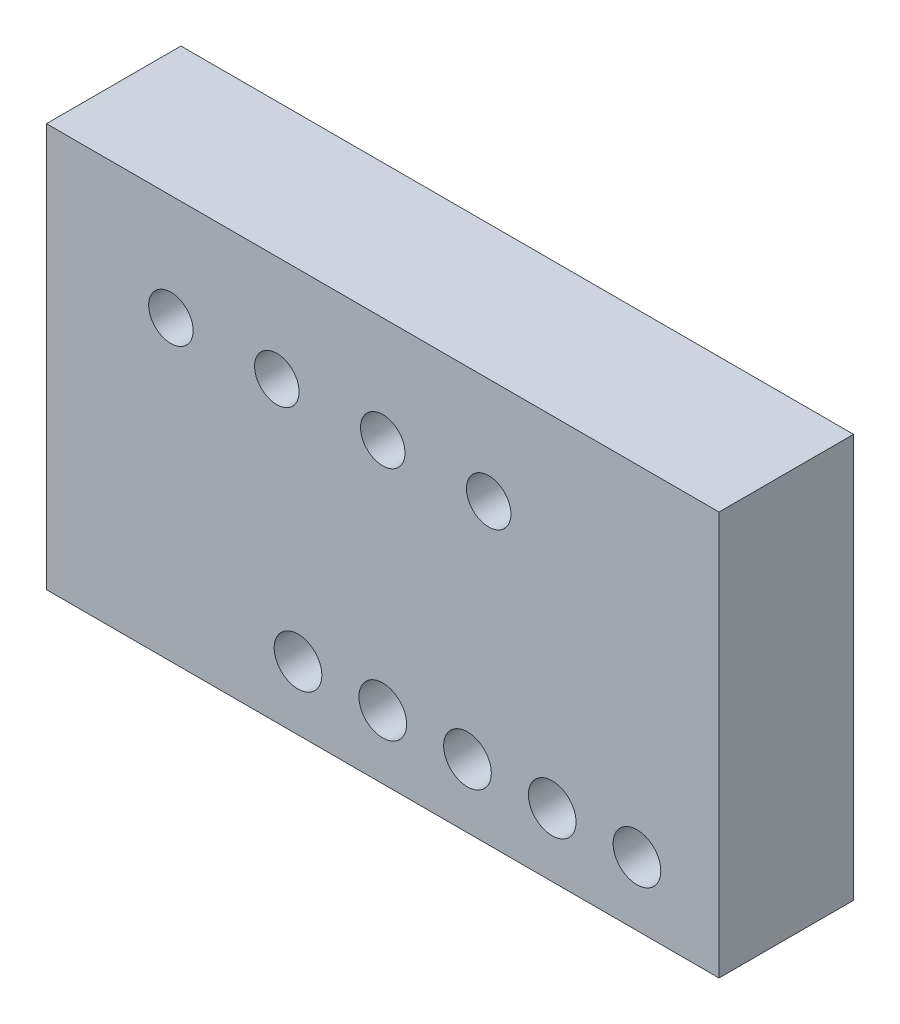
ISO-10303-21;
HEADER;
FILE_DESCRIPTION(('STEP AP214'),'2;1');
FILE_NAME('part.step','',(''),(''),'','','');
FILE_SCHEMA(('AUTOMOTIVE_DESIGN { 1 0 10303 214 1 1 1 1 }'));
ENDSEC;
DATA;
#1=APPLICATION_CONTEXT('core data for automotive mechanical design processes');
#2=APPLICATION_PROTOCOL_DEFINITION('international standard','automotive_design',2000,#1);
#3=PRODUCT_CONTEXT('',#1,'mechanical');
#4=PRODUCT('Part','Part','',(#3));
#5=PRODUCT_RELATED_PRODUCT_CATEGORY('part','',(#4));
#6=PRODUCT_DEFINITION_FORMATION('','',#4);
#7=PRODUCT_DEFINITION_CONTEXT('part definition',#1,'design');
#8=PRODUCT_DEFINITION('design','',#6,#7);
#9=PRODUCT_DEFINITION_SHAPE('','',#8);
#10=(LENGTH_UNIT() NAMED_UNIT(*) SI_UNIT(.MILLI.,.METRE.));
#11=(NAMED_UNIT(*) PLANE_ANGLE_UNIT() SI_UNIT($,.RADIAN.));
#12=(NAMED_UNIT(*) SI_UNIT($,.STERADIAN.) SOLID_ANGLE_UNIT());
#13=UNCERTAINTY_MEASURE_WITH_UNIT(LENGTH_MEASURE(1.E-05),#10,'distance_accuracy_value','');
#14=(GEOMETRIC_REPRESENTATION_CONTEXT(3) GLOBAL_UNCERTAINTY_ASSIGNED_CONTEXT((#13)) GLOBAL_UNIT_ASSIGNED_CONTEXT((#10,
#11,#12)) REPRESENTATION_CONTEXT('',''));
#15=CARTESIAN_POINT('',(0.,0.,0.));
#16=DIRECTION('',(0.,0.,1.));
#17=DIRECTION('',(1.,0.,0.));
#18=AXIS2_PLACEMENT_3D('',#15,#16,#17);
#19=CARTESIAN_POINT('',(-31.75,-19.05,12.7));
#20=DIRECTION('',(1.,0.,0.));
#21=DIRECTION('',(0.,0.,-1.));
#22=AXIS2_PLACEMENT_3D('',#19,#20,#21);
#23=PLANE('',#22);
#24=DIRECTION('',(0.,-1.,0.));
#25=VECTOR('',#24,1.);
#26=CARTESIAN_POINT('',(-31.75,-19.05,0.));
#27=LINE('',#26,#25);
#28=CARTESIAN_POINT('',(-31.75,19.05,0.));
#29=VERTEX_POINT('',#28);
#30=CARTESIAN_POINT('',(-31.75,-19.05,0.));
#31=VERTEX_POINT('',#30);
#32=EDGE_CURVE('E113',#29,#31,#27,.T.);
#33=ORIENTED_EDGE('',*,*,#32,.T.);
#34=DIRECTION('',(0.,0.,-1.));
#35=VECTOR('',#34,1.);
#36=CARTESIAN_POINT('',(-31.75,-19.05,12.7));
#37=LINE('',#36,#35);
#38=CARTESIAN_POINT('',(-31.75,-19.05,12.7));
#39=VERTEX_POINT('',#38);
#40=EDGE_CURVE('E11',#39,#31,#37,.T.);
#41=ORIENTED_EDGE('',*,*,#40,.F.);
#42=DIRECTION('',(0.,-1.,0.));
#43=VECTOR('',#42,1.);
#44=CARTESIAN_POINT('',(-31.75,-19.05,12.7));
#45=LINE('',#44,#43);
#46=CARTESIAN_POINT('',(-31.75,19.05,12.7));
#47=VERTEX_POINT('',#46);
#48=EDGE_CURVE('E95',#47,#39,#45,.T.);
#49=ORIENTED_EDGE('',*,*,#48,.F.);
#50=DIRECTION('',(0.,0.,-1.));
#51=VECTOR('',#50,1.);
#52=CARTESIAN_POINT('',(-31.75,19.05,12.7));
#53=LINE('',#52,#51);
#54=EDGE_CURVE('E109',#47,#29,#53,.T.);
#55=ORIENTED_EDGE('',*,*,#54,.T.);
#56=EDGE_LOOP('',(#33,#41,#49,#55));
#57=FACE_BOUND('',#56,.T.);
#58=ADVANCED_FACE('F43',(#57),#23,.F.);
#59=CARTESIAN_POINT('',(31.75,-19.05,12.7));
#60=DIRECTION('',(0.,1.,0.));
#61=DIRECTION('',(-1.,0.,0.));
#62=AXIS2_PLACEMENT_3D('',#59,#60,#61);
#63=PLANE('',#62);
#64=DIRECTION('',(1.,0.,0.));
#65=VECTOR('',#64,1.);
#66=CARTESIAN_POINT('',(31.75,-19.05,0.));
#67=LINE('',#66,#65);
#68=CARTESIAN_POINT('',(31.75,-19.05,0.));
#69=VERTEX_POINT('',#68);
#70=EDGE_CURVE('E100',#31,#69,#67,.T.);
#71=ORIENTED_EDGE('',*,*,#70,.T.);
#72=DIRECTION('',(0.,0.,-1.));
#73=VECTOR('',#72,1.);
#74=CARTESIAN_POINT('',(31.75,-19.05,12.7));
#75=LINE('',#74,#73);
#76=CARTESIAN_POINT('',(31.75,-19.05,12.7));
#77=VERTEX_POINT('',#76);
#78=EDGE_CURVE('E52',#77,#69,#75,.T.);
#79=ORIENTED_EDGE('',*,*,#78,.F.);
#80=DIRECTION('',(1.,0.,0.));
#81=VECTOR('',#80,1.);
#82=CARTESIAN_POINT('',(31.75,-19.05,12.7));
#83=LINE('',#82,#81);
#84=EDGE_CURVE('E90',#39,#77,#83,.T.);
#85=ORIENTED_EDGE('',*,*,#84,.F.);
#86=ORIENTED_EDGE('',*,*,#40,.T.);
#87=EDGE_LOOP('',(#71,#79,#85,#86));
#88=FACE_BOUND('',#87,.T.);
#89=ADVANCED_FACE('F99',(#88),#63,.F.);
#90=CARTESIAN_POINT('',(31.75,-19.05,12.7));
#91=DIRECTION('',(-1.,0.,0.));
#92=DIRECTION('',(0.,0.,1.));
#93=AXIS2_PLACEMENT_3D('',#90,#91,#92);
#94=PLANE('',#93);
#95=DIRECTION('',(0.,1.,0.));
#96=VECTOR('',#95,1.);
#97=CARTESIAN_POINT('',(31.75,-19.05,0.));
#98=LINE('',#97,#96);
#99=CARTESIAN_POINT('',(31.75,19.05,0.));
#100=VERTEX_POINT('',#99);
#101=EDGE_CURVE('E77',#69,#100,#98,.T.);
#102=ORIENTED_EDGE('',*,*,#101,.T.);
#103=DIRECTION('',(0.,0.,-1.));
#104=VECTOR('',#103,1.);
#105=CARTESIAN_POINT('',(31.75,19.05,12.7));
#106=LINE('',#105,#104);
#107=CARTESIAN_POINT('',(31.75,19.05,12.7));
#108=VERTEX_POINT('',#107);
#109=EDGE_CURVE('E102',#108,#100,#106,.T.);
#110=ORIENTED_EDGE('',*,*,#109,.F.);
#111=DIRECTION('',(0.,1.,0.));
#112=VECTOR('',#111,1.);
#113=CARTESIAN_POINT('',(31.75,-19.05,12.7));
#114=LINE('',#113,#112);
#115=EDGE_CURVE('E93',#77,#108,#114,.T.);
#116=ORIENTED_EDGE('',*,*,#115,.F.);
#117=ORIENTED_EDGE('',*,*,#78,.T.);
#118=EDGE_LOOP('',(#102,#110,#116,#117));
#119=FACE_BOUND('',#118,.T.);
#120=ADVANCED_FACE('F103',(#119),#94,.F.);
#121=CARTESIAN_POINT('',(31.75,19.05,12.7));
#122=DIRECTION('',(0.,-1.,0.));
#123=DIRECTION('',(1.,0.,0.));
#124=AXIS2_PLACEMENT_3D('',#121,#122,#123);
#125=PLANE('',#124);
#126=DIRECTION('',(-1.,0.,0.));
#127=VECTOR('',#126,1.);
#128=CARTESIAN_POINT('',(31.75,19.05,0.));
#129=LINE('',#128,#127);
#130=EDGE_CURVE('E83',#100,#29,#129,.T.);
#131=ORIENTED_EDGE('',*,*,#130,.T.);
#132=ORIENTED_EDGE('',*,*,#54,.F.);
#133=DIRECTION('',(-1.,0.,0.));
#134=VECTOR('',#133,1.);
#135=CARTESIAN_POINT('',(31.75,19.05,12.7));
#136=LINE('',#135,#134);
#137=EDGE_CURVE('E60',#108,#47,#136,.T.);
#138=ORIENTED_EDGE('',*,*,#137,.F.);
#139=ORIENTED_EDGE('',*,*,#109,.T.);
#140=EDGE_LOOP('',(#131,#132,#138,#139));
#141=FACE_BOUND('',#140,.T.);
#142=ADVANCED_FACE('F129',(#141),#125,.F.);
#143=CARTESIAN_POINT('',(0.,0.,12.7));
#144=DIRECTION('',(0.,0.,1.));
#145=DIRECTION('',(1.,0.,0.));
#146=AXIS2_PLACEMENT_3D('',#143,#144,#145);
#147=PLANE('',#146);
#148=CARTESIAN_POINT('',(-20.,9.04999999999999,12.7));
#149=DIRECTION('',(0.,0.,1.));
#150=DIRECTION('',(1.,0.,0.));
#151=AXIS2_PLACEMENT_3D('',#148,#149,#150);
#152=CIRCLE('',#151,2.1);
#153=CARTESIAN_POINT('',(-17.9,9.04999999999999,12.7));
#154=VERTEX_POINT('',#153);
#155=EDGE_CURVE('E205',#154,#154,#152,.T.);
#156=ORIENTED_EDGE('',*,*,#155,.F.);
#157=EDGE_LOOP('',(#156));
#158=FACE_BOUND('',#157,.T.);
#159=CARTESIAN_POINT('',(-10.,9.04999999999999,12.7));
#160=DIRECTION('',(0.,0.,1.));
#161=DIRECTION('',(1.,0.,0.));
#162=AXIS2_PLACEMENT_3D('',#159,#160,#161);
#163=CIRCLE('',#162,2.1);
#164=CARTESIAN_POINT('',(-7.9,9.04999999999999,12.7));
#165=VERTEX_POINT('',#164);
#166=EDGE_CURVE('E197',#165,#165,#163,.T.);
#167=ORIENTED_EDGE('',*,*,#166,.F.);
#168=EDGE_LOOP('',(#167));
#169=FACE_BOUND('',#168,.T.);
#170=CARTESIAN_POINT('',(0.,9.05,12.7));
#171=DIRECTION('',(0.,0.,1.));
#172=DIRECTION('',(1.,0.,0.));
#173=AXIS2_PLACEMENT_3D('',#170,#171,#172);
#174=CIRCLE('',#173,2.1);
#175=CARTESIAN_POINT('',(2.1,9.05,12.7));
#176=VERTEX_POINT('',#175);
#177=EDGE_CURVE('E189',#176,#176,#174,.T.);
#178=ORIENTED_EDGE('',*,*,#177,.F.);
#179=EDGE_LOOP('',(#178));
#180=FACE_BOUND('',#179,.T.);
#181=CARTESIAN_POINT('',(10.,9.04999999999999,12.7));
#182=DIRECTION('',(0.,0.,1.));
#183=DIRECTION('',(1.,0.,0.));
#184=AXIS2_PLACEMENT_3D('',#181,#182,#183);
#185=CIRCLE('',#184,2.1);
#186=CARTESIAN_POINT('',(12.1,9.04999999999999,12.7));
#187=VERTEX_POINT('',#186);
#188=EDGE_CURVE('E181',#187,#187,#185,.T.);
#189=ORIENTED_EDGE('',*,*,#188,.F.);
#190=EDGE_LOOP('',(#189));
#191=FACE_BOUND('',#190,.T.);
#192=CARTESIAN_POINT('',(-8.,-13.05,12.7));
#193=DIRECTION('',(0.,0.,1.));
#194=DIRECTION('',(1.,0.,0.));
#195=AXIS2_PLACEMENT_3D('',#192,#193,#194);
#196=CIRCLE('',#195,2.25);
#197=CARTESIAN_POINT('',(-5.75,-13.05,12.7));
#198=VERTEX_POINT('',#197);
#199=EDGE_CURVE('E173',#198,#198,#196,.T.);
#200=ORIENTED_EDGE('',*,*,#199,.F.);
#201=EDGE_LOOP('',(#200));
#202=FACE_BOUND('',#201,.T.);
#203=CARTESIAN_POINT('',(0.,-13.05,12.7));
#204=DIRECTION('',(0.,0.,1.));
#205=DIRECTION('',(1.,0.,0.));
#206=AXIS2_PLACEMENT_3D('',#203,#204,#205);
#207=CIRCLE('',#206,2.25);
#208=CARTESIAN_POINT('',(2.25,-13.05,12.7));
#209=VERTEX_POINT('',#208);
#210=EDGE_CURVE('E165',#209,#209,#207,.T.);
#211=ORIENTED_EDGE('',*,*,#210,.F.);
#212=EDGE_LOOP('',(#211));
#213=FACE_BOUND('',#212,.T.);
#214=CARTESIAN_POINT('',(8.,-13.05,12.7));
#215=DIRECTION('',(0.,0.,1.));
#216=DIRECTION('',(1.,0.,0.));
#217=AXIS2_PLACEMENT_3D('',#214,#215,#216);
#218=CIRCLE('',#217,2.25);
#219=CARTESIAN_POINT('',(10.25,-13.05,12.7));
#220=VERTEX_POINT('',#219);
#221=EDGE_CURVE('E157',#220,#220,#218,.T.);
#222=ORIENTED_EDGE('',*,*,#221,.F.);
#223=EDGE_LOOP('',(#222));
#224=FACE_BOUND('',#223,.T.);
#225=CARTESIAN_POINT('',(16.,-13.05,12.7));
#226=DIRECTION('',(0.,0.,1.));
#227=DIRECTION('',(1.,0.,0.));
#228=AXIS2_PLACEMENT_3D('',#225,#226,#227);
#229=CIRCLE('',#228,2.25);
#230=CARTESIAN_POINT('',(18.25,-13.05,12.7));
#231=VERTEX_POINT('',#230);
#232=EDGE_CURVE('E149',#231,#231,#229,.T.);
#233=ORIENTED_EDGE('',*,*,#232,.F.);
#234=EDGE_LOOP('',(#233));
#235=FACE_BOUND('',#234,.T.);
#236=CARTESIAN_POINT('',(24.,-13.05,12.7));
#237=DIRECTION('',(0.,0.,1.));
#238=DIRECTION('',(1.,0.,0.));
#239=AXIS2_PLACEMENT_3D('',#236,#237,#238);
#240=CIRCLE('',#239,2.25);
#241=CARTESIAN_POINT('',(26.25,-13.05,12.7));
#242=VERTEX_POINT('',#241);
#243=EDGE_CURVE('E141',#242,#242,#240,.T.);
#244=ORIENTED_EDGE('',*,*,#243,.F.);
#245=EDGE_LOOP('',(#244));
#246=FACE_BOUND('',#245,.T.);
#247=ORIENTED_EDGE('',*,*,#48,.T.);
#248=ORIENTED_EDGE('',*,*,#84,.T.);
#249=ORIENTED_EDGE('',*,*,#115,.T.);
#250=ORIENTED_EDGE('',*,*,#137,.T.);
#251=EDGE_LOOP('',(#247,#248,#249,#250));
#252=FACE_BOUND('',#251,.T.);
#253=ADVANCED_FACE('F91',(#158,#169,#180,#191,#202,#213,#224,#235,#246,#252),#147,.T.);
#254=CARTESIAN_POINT('',(0.,0.,0.));
#255=DIRECTION('',(0.,0.,1.));
#256=DIRECTION('',(1.,0.,0.));
#257=AXIS2_PLACEMENT_3D('',#254,#255,#256);
#258=PLANE('',#257);
#259=CARTESIAN_POINT('',(-20.,9.04999999999999,0.));
#260=DIRECTION('',(0.,0.,1.));
#261=DIRECTION('',(1.,0.,0.));
#262=AXIS2_PLACEMENT_3D('',#259,#260,#261);
#263=CIRCLE('',#262,2.1);
#264=CARTESIAN_POINT('',(-17.9,9.04999999999999,0.));
#265=VERTEX_POINT('',#264);
#266=EDGE_CURVE('E201',#265,#265,#263,.T.);
#267=ORIENTED_EDGE('',*,*,#266,.T.);
#268=EDGE_LOOP('',(#267));
#269=FACE_BOUND('',#268,.T.);
#270=CARTESIAN_POINT('',(-10.,9.04999999999999,0.));
#271=DIRECTION('',(0.,0.,1.));
#272=DIRECTION('',(1.,0.,0.));
#273=AXIS2_PLACEMENT_3D('',#270,#271,#272);
#274=CIRCLE('',#273,2.1);
#275=CARTESIAN_POINT('',(-7.9,9.04999999999999,0.));
#276=VERTEX_POINT('',#275);
#277=EDGE_CURVE('E193',#276,#276,#274,.T.);
#278=ORIENTED_EDGE('',*,*,#277,.T.);
#279=EDGE_LOOP('',(#278));
#280=FACE_BOUND('',#279,.T.);
#281=CARTESIAN_POINT('',(0.,9.05,0.));
#282=DIRECTION('',(0.,0.,1.));
#283=DIRECTION('',(1.,0.,0.));
#284=AXIS2_PLACEMENT_3D('',#281,#282,#283);
#285=CIRCLE('',#284,2.1);
#286=CARTESIAN_POINT('',(2.1,9.05,0.));
#287=VERTEX_POINT('',#286);
#288=EDGE_CURVE('E185',#287,#287,#285,.T.);
#289=ORIENTED_EDGE('',*,*,#288,.T.);
#290=EDGE_LOOP('',(#289));
#291=FACE_BOUND('',#290,.T.);
#292=CARTESIAN_POINT('',(10.,9.04999999999999,0.));
#293=DIRECTION('',(0.,0.,1.));
#294=DIRECTION('',(1.,0.,0.));
#295=AXIS2_PLACEMENT_3D('',#292,#293,#294);
#296=CIRCLE('',#295,2.1);
#297=CARTESIAN_POINT('',(12.1,9.04999999999999,0.));
#298=VERTEX_POINT('',#297);
#299=EDGE_CURVE('E177',#298,#298,#296,.T.);
#300=ORIENTED_EDGE('',*,*,#299,.T.);
#301=EDGE_LOOP('',(#300));
#302=FACE_BOUND('',#301,.T.);
#303=CARTESIAN_POINT('',(-8.,-13.05,0.));
#304=DIRECTION('',(0.,0.,1.));
#305=DIRECTION('',(1.,0.,0.));
#306=AXIS2_PLACEMENT_3D('',#303,#304,#305);
#307=CIRCLE('',#306,2.25);
#308=CARTESIAN_POINT('',(-5.75,-13.05,0.));
#309=VERTEX_POINT('',#308);
#310=EDGE_CURVE('E169',#309,#309,#307,.T.);
#311=ORIENTED_EDGE('',*,*,#310,.T.);
#312=EDGE_LOOP('',(#311));
#313=FACE_BOUND('',#312,.T.);
#314=CARTESIAN_POINT('',(0.,-13.05,0.));
#315=DIRECTION('',(0.,0.,1.));
#316=DIRECTION('',(1.,0.,0.));
#317=AXIS2_PLACEMENT_3D('',#314,#315,#316);
#318=CIRCLE('',#317,2.25);
#319=CARTESIAN_POINT('',(2.25,-13.05,0.));
#320=VERTEX_POINT('',#319);
#321=EDGE_CURVE('E161',#320,#320,#318,.T.);
#322=ORIENTED_EDGE('',*,*,#321,.T.);
#323=EDGE_LOOP('',(#322));
#324=FACE_BOUND('',#323,.T.);
#325=CARTESIAN_POINT('',(8.,-13.05,0.));
#326=DIRECTION('',(0.,0.,1.));
#327=DIRECTION('',(1.,0.,0.));
#328=AXIS2_PLACEMENT_3D('',#325,#326,#327);
#329=CIRCLE('',#328,2.25);
#330=CARTESIAN_POINT('',(10.25,-13.05,0.));
#331=VERTEX_POINT('',#330);
#332=EDGE_CURVE('E153',#331,#331,#329,.T.);
#333=ORIENTED_EDGE('',*,*,#332,.T.);
#334=EDGE_LOOP('',(#333));
#335=FACE_BOUND('',#334,.T.);
#336=CARTESIAN_POINT('',(16.,-13.05,0.));
#337=DIRECTION('',(0.,0.,1.));
#338=DIRECTION('',(1.,0.,0.));
#339=AXIS2_PLACEMENT_3D('',#336,#337,#338);
#340=CIRCLE('',#339,2.25);
#341=CARTESIAN_POINT('',(18.25,-13.05,0.));
#342=VERTEX_POINT('',#341);
#343=EDGE_CURVE('E145',#342,#342,#340,.T.);
#344=ORIENTED_EDGE('',*,*,#343,.T.);
#345=EDGE_LOOP('',(#344));
#346=FACE_BOUND('',#345,.T.);
#347=CARTESIAN_POINT('',(24.,-13.05,0.));
#348=DIRECTION('',(0.,0.,1.));
#349=DIRECTION('',(1.,0.,0.));
#350=AXIS2_PLACEMENT_3D('',#347,#348,#349);
#351=CIRCLE('',#350,2.25);
#352=CARTESIAN_POINT('',(26.25,-13.05,0.));
#353=VERTEX_POINT('',#352);
#354=EDGE_CURVE('E117',#353,#353,#351,.T.);
#355=ORIENTED_EDGE('',*,*,#354,.T.);
#356=EDGE_LOOP('',(#355));
#357=FACE_BOUND('',#356,.T.);
#358=ORIENTED_EDGE('',*,*,#32,.F.);
#359=ORIENTED_EDGE('',*,*,#130,.F.);
#360=ORIENTED_EDGE('',*,*,#101,.F.);
#361=ORIENTED_EDGE('',*,*,#70,.F.);
#362=EDGE_LOOP('',(#358,#359,#360,#361));
#363=FACE_BOUND('',#362,.T.);
#364=ADVANCED_FACE('F132',(#269,#280,#291,#302,#313,#324,#335,#346,#357,#363),#258,.F.);
#365=CARTESIAN_POINT('',(24.,-13.05,12.7));
#366=DIRECTION('',(0.,0.,1.));
#367=DIRECTION('',(1.,0.,0.));
#368=AXIS2_PLACEMENT_3D('',#365,#366,#367);
#369=CYLINDRICAL_SURFACE('',#368,2.25);
#370=ORIENTED_EDGE('',*,*,#354,.F.);
#371=EDGE_LOOP('',(#370));
#372=FACE_BOUND('',#371,.T.);
#373=ORIENTED_EDGE('',*,*,#243,.T.);
#374=EDGE_LOOP('',(#373));
#375=FACE_BOUND('',#374,.T.);
#376=ADVANCED_FACE('F233',(#372,#375),#369,.F.);
#377=CARTESIAN_POINT('',(16.,-13.05,12.7));
#378=DIRECTION('',(0.,0.,1.));
#379=DIRECTION('',(1.,0.,0.));
#380=AXIS2_PLACEMENT_3D('',#377,#378,#379);
#381=CYLINDRICAL_SURFACE('',#380,2.25);
#382=ORIENTED_EDGE('',*,*,#343,.F.);
#383=EDGE_LOOP('',(#382));
#384=FACE_BOUND('',#383,.T.);
#385=ORIENTED_EDGE('',*,*,#232,.T.);
#386=EDGE_LOOP('',(#385));
#387=FACE_BOUND('',#386,.T.);
#388=ADVANCED_FACE('F235',(#384,#387),#381,.F.);
#389=CARTESIAN_POINT('',(8.,-13.05,12.7));
#390=DIRECTION('',(0.,0.,1.));
#391=DIRECTION('',(1.,0.,0.));
#392=AXIS2_PLACEMENT_3D('',#389,#390,#391);
#393=CYLINDRICAL_SURFACE('',#392,2.25);
#394=ORIENTED_EDGE('',*,*,#332,.F.);
#395=EDGE_LOOP('',(#394));
#396=FACE_BOUND('',#395,.T.);
#397=ORIENTED_EDGE('',*,*,#221,.T.);
#398=EDGE_LOOP('',(#397));
#399=FACE_BOUND('',#398,.T.);
#400=ADVANCED_FACE('F242',(#396,#399),#393,.F.);
#401=CARTESIAN_POINT('',(0.,-13.05,12.7));
#402=DIRECTION('',(0.,0.,1.));
#403=DIRECTION('',(1.,0.,0.));
#404=AXIS2_PLACEMENT_3D('',#401,#402,#403);
#405=CYLINDRICAL_SURFACE('',#404,2.25);
#406=ORIENTED_EDGE('',*,*,#321,.F.);
#407=EDGE_LOOP('',(#406));
#408=FACE_BOUND('',#407,.T.);
#409=ORIENTED_EDGE('',*,*,#210,.T.);
#410=EDGE_LOOP('',(#409));
#411=FACE_BOUND('',#410,.T.);
#412=ADVANCED_FACE('F290',(#408,#411),#405,.F.);
#413=CARTESIAN_POINT('',(-8.,-13.05,12.7));
#414=DIRECTION('',(0.,0.,1.));
#415=DIRECTION('',(1.,0.,0.));
#416=AXIS2_PLACEMENT_3D('',#413,#414,#415);
#417=CYLINDRICAL_SURFACE('',#416,2.25);
#418=ORIENTED_EDGE('',*,*,#310,.F.);
#419=EDGE_LOOP('',(#418));
#420=FACE_BOUND('',#419,.T.);
#421=ORIENTED_EDGE('',*,*,#199,.T.);
#422=EDGE_LOOP('',(#421));
#423=FACE_BOUND('',#422,.T.);
#424=ADVANCED_FACE('F300',(#420,#423),#417,.F.);
#425=CARTESIAN_POINT('',(10.,9.04999999999999,12.7));
#426=DIRECTION('',(0.,0.,1.));
#427=DIRECTION('',(1.,0.,0.));
#428=AXIS2_PLACEMENT_3D('',#425,#426,#427);
#429=CYLINDRICAL_SURFACE('',#428,2.1);
#430=ORIENTED_EDGE('',*,*,#299,.F.);
#431=EDGE_LOOP('',(#430));
#432=FACE_BOUND('',#431,.T.);
#433=ORIENTED_EDGE('',*,*,#188,.T.);
#434=EDGE_LOOP('',(#433));
#435=FACE_BOUND('',#434,.T.);
#436=ADVANCED_FACE('F310',(#432,#435),#429,.F.);
#437=CARTESIAN_POINT('',(0.,9.05,12.7));
#438=DIRECTION('',(0.,0.,1.));
#439=DIRECTION('',(1.,0.,0.));
#440=AXIS2_PLACEMENT_3D('',#437,#438,#439);
#441=CYLINDRICAL_SURFACE('',#440,2.1);
#442=ORIENTED_EDGE('',*,*,#288,.F.);
#443=EDGE_LOOP('',(#442));
#444=FACE_BOUND('',#443,.T.);
#445=ORIENTED_EDGE('',*,*,#177,.T.);
#446=EDGE_LOOP('',(#445));
#447=FACE_BOUND('',#446,.T.);
#448=ADVANCED_FACE('F319',(#444,#447),#441,.F.);
#449=CARTESIAN_POINT('',(-10.,9.04999999999999,12.7));
#450=DIRECTION('',(0.,0.,1.));
#451=DIRECTION('',(1.,0.,0.));
#452=AXIS2_PLACEMENT_3D('',#449,#450,#451);
#453=CYLINDRICAL_SURFACE('',#452,2.1);
#454=ORIENTED_EDGE('',*,*,#277,.F.);
#455=EDGE_LOOP('',(#454));
#456=FACE_BOUND('',#455,.T.);
#457=ORIENTED_EDGE('',*,*,#166,.T.);
#458=EDGE_LOOP('',(#457));
#459=FACE_BOUND('',#458,.T.);
#460=ADVANCED_FACE('F329',(#456,#459),#453,.F.);
#461=CARTESIAN_POINT('',(-20.,9.04999999999999,12.7));
#462=DIRECTION('',(0.,0.,1.));
#463=DIRECTION('',(1.,0.,0.));
#464=AXIS2_PLACEMENT_3D('',#461,#462,#463);
#465=CYLINDRICAL_SURFACE('',#464,2.1);
#466=ORIENTED_EDGE('',*,*,#266,.F.);
#467=EDGE_LOOP('',(#466));
#468=FACE_BOUND('',#467,.T.);
#469=ORIENTED_EDGE('',*,*,#155,.T.);
#470=EDGE_LOOP('',(#469));
#471=FACE_BOUND('',#470,.T.);
#472=ADVANCED_FACE('F212',(#468,#471),#465,.F.);
#473=CLOSED_SHELL('',(#58,#89,#120,#142,#253,#364,#376,#388,#400,#412,#424,#436,#448,#460,#472));
#474=MANIFOLD_SOLID_BREP('B2',#473);
#475=ADVANCED_BREP_SHAPE_REPRESENTATION('',(#18,#474),#14);
#476=SHAPE_DEFINITION_REPRESENTATION(#9,#475);
ENDSEC;
END-ISO-10303-21;
